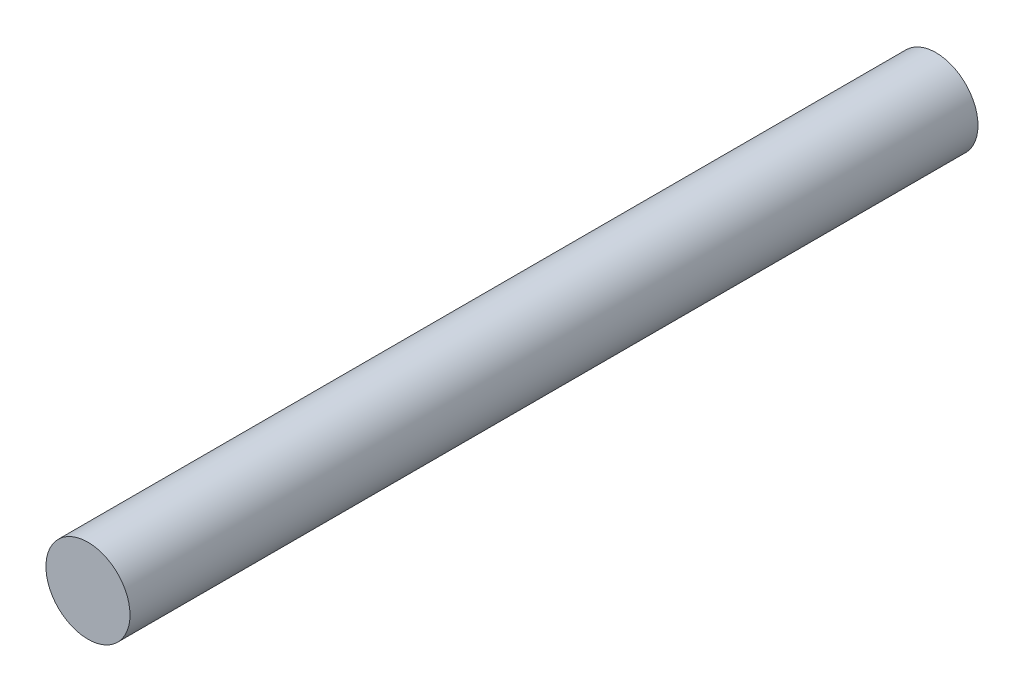
ISO-10303-21;
HEADER;
FILE_DESCRIPTION(('STEP AP214'),'2;1');
FILE_NAME('part.step','',(''),(''),'','','');
FILE_SCHEMA(('AUTOMOTIVE_DESIGN { 1 0 10303 214 1 1 1 1 }'));
ENDSEC;
DATA;
#1=APPLICATION_CONTEXT('core data for automotive mechanical design processes');
#2=APPLICATION_PROTOCOL_DEFINITION('international standard','automotive_design',2000,#1);
#3=PRODUCT_CONTEXT('',#1,'mechanical');
#4=PRODUCT('Part','Part','',(#3));
#5=PRODUCT_RELATED_PRODUCT_CATEGORY('part','',(#4));
#6=PRODUCT_DEFINITION_FORMATION('','',#4);
#7=PRODUCT_DEFINITION_CONTEXT('part definition',#1,'design');
#8=PRODUCT_DEFINITION('design','',#6,#7);
#9=PRODUCT_DEFINITION_SHAPE('','',#8);
#10=(LENGTH_UNIT() NAMED_UNIT(*) SI_UNIT(.MILLI.,.METRE.));
#11=(NAMED_UNIT(*) PLANE_ANGLE_UNIT() SI_UNIT($,.RADIAN.));
#12=(NAMED_UNIT(*) SI_UNIT($,.STERADIAN.) SOLID_ANGLE_UNIT());
#13=UNCERTAINTY_MEASURE_WITH_UNIT(LENGTH_MEASURE(1.E-05),#10,'distance_accuracy_value','');
#14=(GEOMETRIC_REPRESENTATION_CONTEXT(3) GLOBAL_UNCERTAINTY_ASSIGNED_CONTEXT((#13)) GLOBAL_UNIT_ASSIGNED_CONTEXT((#10,
#11,#12)) REPRESENTATION_CONTEXT('',''));
#15=CARTESIAN_POINT('',(0.,0.,0.));
#16=DIRECTION('',(0.,0.,1.));
#17=DIRECTION('',(1.,0.,0.));
#18=AXIS2_PLACEMENT_3D('',#15,#16,#17);
#19=CARTESIAN_POINT('',(0.,0.,121.));
#20=DIRECTION('',(0.,0.,-1.));
#21=DIRECTION('',(-1.,0.,0.));
#22=AXIS2_PLACEMENT_3D('',#19,#20,#21);
#23=CYLINDRICAL_SURFACE('',#22,6.);
#24=CARTESIAN_POINT('',(0.,0.,121.));
#25=DIRECTION('',(0.,0.,1.));
#26=DIRECTION('',(1.,0.,0.));
#27=AXIS2_PLACEMENT_3D('',#24,#25,#26);
#28=CIRCLE('',#27,6.);
#29=CARTESIAN_POINT('',(6.,0.,121.));
#30=VERTEX_POINT('',#29);
#31=EDGE_CURVE('E10',#30,#30,#28,.T.);
#32=ORIENTED_EDGE('',*,*,#31,.F.);
#33=EDGE_LOOP('',(#32));
#34=FACE_BOUND('',#33,.T.);
#35=CARTESIAN_POINT('',(0.,0.,0.));
#36=DIRECTION('',(0.,0.,1.));
#37=DIRECTION('',(1.,0.,0.));
#38=AXIS2_PLACEMENT_3D('',#35,#36,#37);
#39=CIRCLE('',#38,6.);
#40=CARTESIAN_POINT('',(6.,0.,0.));
#41=VERTEX_POINT('',#40);
#42=EDGE_CURVE('E34',#41,#41,#39,.T.);
#43=ORIENTED_EDGE('',*,*,#42,.T.);
#44=EDGE_LOOP('',(#43));
#45=FACE_BOUND('',#44,.T.);
#46=ADVANCED_FACE('F31',(#34,#45),#23,.T.);
#47=CARTESIAN_POINT('',(0.,0.,121.));
#48=DIRECTION('',(0.,0.,1.));
#49=DIRECTION('',(1.,0.,0.));
#50=AXIS2_PLACEMENT_3D('',#47,#48,#49);
#51=PLANE('',#50);
#52=ORIENTED_EDGE('',*,*,#31,.T.);
#53=EDGE_LOOP('',(#52));
#54=FACE_BOUND('',#53,.T.);
#55=ADVANCED_FACE('F46',(#54),#51,.T.);
#56=CARTESIAN_POINT('',(0.,0.,0.));
#57=DIRECTION('',(0.,0.,1.));
#58=DIRECTION('',(1.,0.,0.));
#59=AXIS2_PLACEMENT_3D('',#56,#57,#58);
#60=PLANE('',#59);
#61=ORIENTED_EDGE('',*,*,#42,.F.);
#62=EDGE_LOOP('',(#61));
#63=FACE_BOUND('',#62,.T.);
#64=ADVANCED_FACE('F44',(#63),#60,.F.);
#65=CLOSED_SHELL('',(#46,#55,#64));
#66=MANIFOLD_SOLID_BREP('B2',#65);
#67=ADVANCED_BREP_SHAPE_REPRESENTATION('',(#18,#66),#14);
#68=SHAPE_DEFINITION_REPRESENTATION(#9,#67);
ENDSEC;
END-ISO-10303-21;
